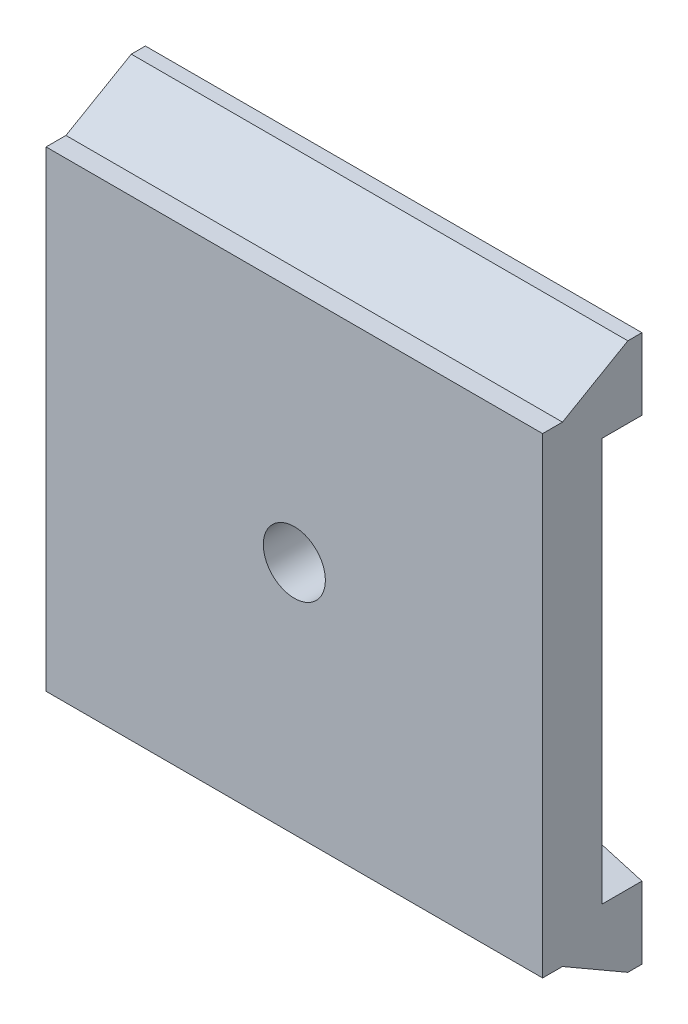
ISO-10303-21;
HEADER;
FILE_DESCRIPTION(('STEP AP214'),'2;1');
FILE_NAME('part.step','',(''),(''),'','','');
FILE_SCHEMA(('AUTOMOTIVE_DESIGN { 1 0 10303 214 1 1 1 1 }'));
ENDSEC;
DATA;
#1=APPLICATION_CONTEXT('core data for automotive mechanical design processes');
#2=APPLICATION_PROTOCOL_DEFINITION('international standard','automotive_design',2000,#1);
#3=PRODUCT_CONTEXT('',#1,'mechanical');
#4=PRODUCT('Part','Part','',(#3));
#5=PRODUCT_RELATED_PRODUCT_CATEGORY('part','',(#4));
#6=PRODUCT_DEFINITION_FORMATION('','',#4);
#7=PRODUCT_DEFINITION_CONTEXT('part definition',#1,'design');
#8=PRODUCT_DEFINITION('design','',#6,#7);
#9=PRODUCT_DEFINITION_SHAPE('','',#8);
#10=(LENGTH_UNIT() NAMED_UNIT(*) SI_UNIT(.MILLI.,.METRE.));
#11=(NAMED_UNIT(*) PLANE_ANGLE_UNIT() SI_UNIT($,.RADIAN.));
#12=(NAMED_UNIT(*) SI_UNIT($,.STERADIAN.) SOLID_ANGLE_UNIT());
#13=UNCERTAINTY_MEASURE_WITH_UNIT(LENGTH_MEASURE(1.E-05),#10,'distance_accuracy_value','');
#14=(GEOMETRIC_REPRESENTATION_CONTEXT(3) GLOBAL_UNCERTAINTY_ASSIGNED_CONTEXT((#13)) GLOBAL_UNIT_ASSIGNED_CONTEXT((#10,
#11,#12)) REPRESENTATION_CONTEXT('',''));
#15=CARTESIAN_POINT('',(0.,0.,0.));
#16=DIRECTION('',(0.,0.,1.));
#17=DIRECTION('',(1.,0.,0.));
#18=AXIS2_PLACEMENT_3D('',#15,#16,#17);
#19=CARTESIAN_POINT('',(25.4,-16.9926,4.064));
#20=DIRECTION('',(0.,-1.,0.));
#21=DIRECTION('',(0.,0.,-1.));
#22=AXIS2_PLACEMENT_3D('',#19,#20,#21);
#23=PLANE('',#22);
#24=DIRECTION('',(-1.,0.,0.));
#25=VECTOR('',#24,1.);
#26=CARTESIAN_POINT('',(25.4,-16.9926,0.));
#27=LINE('',#26,#25);
#28=CARTESIAN_POINT('',(-9.525,-16.9926,0.));
#29=VERTEX_POINT('',#28);
#30=CARTESIAN_POINT('',(-12.7,-16.9926,0.));
#31=VERTEX_POINT('',#30);
#32=EDGE_CURVE('E352',#29,#31,#27,.T.);
#33=ORIENTED_EDGE('',*,*,#32,.T.);
#34=DIRECTION('',(0.,0.,-1.));
#35=VECTOR('',#34,1.);
#36=CARTESIAN_POINT('',(-12.7,-16.9926,4.064));
#37=LINE('',#36,#35);
#38=CARTESIAN_POINT('',(-12.7,-16.9926,4.064));
#39=VERTEX_POINT('',#38);
#40=EDGE_CURVE('E246',#39,#31,#37,.T.);
#41=ORIENTED_EDGE('',*,*,#40,.F.);
#42=DIRECTION('',(-1.,0.,0.));
#43=VECTOR('',#42,1.);
#44=CARTESIAN_POINT('',(25.4,-16.9926,4.064));
#45=LINE('',#44,#43);
#46=CARTESIAN_POINT('',(-9.525,-16.9926,4.064));
#47=VERTEX_POINT('',#46);
#48=EDGE_CURVE('E346',#47,#39,#45,.T.);
#49=ORIENTED_EDGE('',*,*,#48,.F.);
#50=DIRECTION('',(0.,0.,-1.));
#51=VECTOR('',#50,1.);
#52=CARTESIAN_POINT('',(-9.525,-16.9926,4.064));
#53=LINE('',#52,#51);
#54=EDGE_CURVE('E338',#47,#29,#53,.T.);
#55=ORIENTED_EDGE('',*,*,#54,.T.);
#56=EDGE_LOOP('',(#33,#41,#49,#55));
#57=FACE_BOUND('',#56,.T.);
#58=ADVANCED_FACE('F33',(#57),#23,.F.);
#59=CARTESIAN_POINT('',(25.4,16.9926,4.064));
#60=DIRECTION('',(0.,1.,0.));
#61=DIRECTION('',(0.,0.,1.));
#62=AXIS2_PLACEMENT_3D('',#59,#60,#61);
#63=PLANE('',#62);
#64=DIRECTION('',(1.,0.,0.));
#65=VECTOR('',#64,1.);
#66=CARTESIAN_POINT('',(25.4,16.9926,4.064));
#67=LINE('',#66,#65);
#68=CARTESIAN_POINT('',(-12.7,16.9926,4.064));
#69=VERTEX_POINT('',#68);
#70=CARTESIAN_POINT('',(-9.525,16.9926,4.064));
#71=VERTEX_POINT('',#70);
#72=EDGE_CURVE('E342',#69,#71,#67,.T.);
#73=ORIENTED_EDGE('',*,*,#72,.F.);
#74=DIRECTION('',(0.,0.,-1.));
#75=VECTOR('',#74,1.);
#76=CARTESIAN_POINT('',(-12.7,16.9926,4.064));
#77=LINE('',#76,#75);
#78=CARTESIAN_POINT('',(-12.7,16.9926,0.));
#79=VERTEX_POINT('',#78);
#80=EDGE_CURVE('E232',#69,#79,#77,.T.);
#81=ORIENTED_EDGE('',*,*,#80,.T.);
#82=DIRECTION('',(1.,0.,0.));
#83=VECTOR('',#82,1.);
#84=CARTESIAN_POINT('',(25.4,16.9926,0.));
#85=LINE('',#84,#83);
#86=CARTESIAN_POINT('',(-9.525,16.9926,0.));
#87=VERTEX_POINT('',#86);
#88=EDGE_CURVE('E350',#79,#87,#85,.T.);
#89=ORIENTED_EDGE('',*,*,#88,.T.);
#90=DIRECTION('',(0.,0.,1.));
#91=VECTOR('',#90,1.);
#92=CARTESIAN_POINT('',(-9.525,16.9926,4.064));
#93=LINE('',#92,#91);
#94=EDGE_CURVE('E11',#87,#71,#93,.T.);
#95=ORIENTED_EDGE('',*,*,#94,.T.);
#96=EDGE_LOOP('',(#73,#81,#89,#95));
#97=FACE_BOUND('',#96,.T.);
#98=ADVANCED_FACE('F519',(#97),#63,.F.);
#99=CARTESIAN_POINT('',(0.,0.,0.));
#100=DIRECTION('',(0.,0.,1.));
#101=DIRECTION('',(1.,0.,0.));
#102=AXIS2_PLACEMENT_3D('',#99,#100,#101);
#103=PLANE('',#102);
#104=DIRECTION('',(0.,-1.,0.));
#105=VECTOR('',#104,1.);
#106=CARTESIAN_POINT('',(-25.4,27.9781,0.));
#107=LINE('',#106,#105);
#108=CARTESIAN_POINT('',(-25.4,-20.6587742093541,0.));
#109=VERTEX_POINT('',#108);
#110=CARTESIAN_POINT('',(-25.4,-27.9781,0.));
#111=VERTEX_POINT('',#110);
#112=EDGE_CURVE('E405',#109,#111,#107,.T.);
#113=ORIENTED_EDGE('',*,*,#112,.F.);
#114=DIRECTION('',(-0.960768922830524,-0.277350098112611,0.));
#115=VECTOR('',#114,1.);
#116=CARTESIAN_POINT('',(-12.7,-16.9926,0.));
#117=LINE('',#116,#115);
#118=EDGE_CURVE('E241',#31,#109,#117,.T.);
#119=ORIENTED_EDGE('',*,*,#118,.F.);
#120=ORIENTED_EDGE('',*,*,#32,.F.);
#121=DIRECTION('',(0.,1.,0.));
#122=VECTOR('',#121,1.);
#123=CARTESIAN_POINT('',(-9.525,17.8308,0.));
#124=LINE('',#123,#122);
#125=CARTESIAN_POINT('',(-9.525,-17.8308,0.));
#126=VERTEX_POINT('',#125);
#127=EDGE_CURVE('E274',#126,#29,#124,.T.);
#128=ORIENTED_EDGE('',*,*,#127,.F.);
#129=CARTESIAN_POINT('',(-6.35,-17.8308,0.));
#130=DIRECTION('',(0.,0.,-1.));
#131=DIRECTION('',(1.,0.,0.));
#132=AXIS2_PLACEMENT_3D('',#129,#130,#131);
#133=CIRCLE('',#132,3.175);
#134=CARTESIAN_POINT('',(-6.35,-21.0058,0.));
#135=VERTEX_POINT('',#134);
#136=EDGE_CURVE('E313',#135,#126,#133,.T.);
#137=ORIENTED_EDGE('',*,*,#136,.F.);
#138=DIRECTION('',(-1.,0.,0.));
#139=VECTOR('',#138,1.);
#140=CARTESIAN_POINT('',(-6.35,-21.0058,0.));
#141=LINE('',#140,#139);
#142=CARTESIAN_POINT('',(6.35,-21.0058,0.));
#143=VERTEX_POINT('',#142);
#144=EDGE_CURVE('E310',#143,#135,#141,.T.);
#145=ORIENTED_EDGE('',*,*,#144,.F.);
#146=CARTESIAN_POINT('',(6.35,-17.8308,0.));
#147=DIRECTION('',(0.,0.,-1.));
#148=DIRECTION('',(1.,0.,0.));
#149=AXIS2_PLACEMENT_3D('',#146,#147,#148);
#150=CIRCLE('',#149,3.175);
#151=CARTESIAN_POINT('',(9.525,-17.8308,0.));
#152=VERTEX_POINT('',#151);
#153=EDGE_CURVE('E307',#152,#143,#150,.T.);
#154=ORIENTED_EDGE('',*,*,#153,.F.);
#155=DIRECTION('',(0.,-1.,0.));
#156=VECTOR('',#155,1.);
#157=CARTESIAN_POINT('',(9.525,17.8308,0.));
#158=LINE('',#157,#156);
#159=CARTESIAN_POINT('',(9.525,-16.9926,0.));
#160=VERTEX_POINT('',#159);
#161=EDGE_CURVE('E304',#160,#152,#158,.T.);
#162=ORIENTED_EDGE('',*,*,#161,.F.);
#163=CARTESIAN_POINT('',(12.8616842040088,-16.9926,0.));
#164=VERTEX_POINT('',#163);
#165=EDGE_CURVE('E225',#164,#160,#27,.T.);
#166=ORIENTED_EDGE('',*,*,#165,.F.);
#167=DIRECTION('',(-0.960768922830524,0.277350098112611,0.));
#168=VECTOR('',#167,1.);
#169=CARTESIAN_POINT('',(12.8616842040088,-16.9926,0.));
#170=LINE('',#169,#168);
#171=CARTESIAN_POINT('',(25.4,-20.6121,0.));
#172=VERTEX_POINT('',#171);
#173=EDGE_CURVE('E250',#172,#164,#170,.T.);
#174=ORIENTED_EDGE('',*,*,#173,.F.);
#175=DIRECTION('',(0.,1.,0.));
#176=VECTOR('',#175,1.);
#177=CARTESIAN_POINT('',(25.4,27.9781,0.));
#178=LINE('',#177,#176);
#179=CARTESIAN_POINT('',(25.4,-27.9781,0.));
#180=VERTEX_POINT('',#179);
#181=EDGE_CURVE('E399',#180,#172,#178,.T.);
#182=ORIENTED_EDGE('',*,*,#181,.F.);
#183=DIRECTION('',(1.,0.,0.));
#184=VECTOR('',#183,1.);
#185=CARTESIAN_POINT('',(-25.4,-27.9781,0.));
#186=LINE('',#185,#184);
#187=EDGE_CURVE('E395',#111,#180,#186,.T.);
#188=ORIENTED_EDGE('',*,*,#187,.F.);
#189=EDGE_LOOP('',(#113,#119,#120,#128,#137,#145,#154,#162,#166,#174,#182,#188));
#190=FACE_BOUND('',#189,.T.);
#191=ADVANCED_FACE('F484',(#190),#103,.F.);
#192=CARTESIAN_POINT('',(-25.4,27.9781,10.16));
#193=DIRECTION('',(0.,-1.,0.));
#194=DIRECTION('',(0.,0.,-1.));
#195=AXIS2_PLACEMENT_3D('',#192,#193,#194);
#196=PLANE('',#195);
#197=DIRECTION('',(0.,0.,-1.));
#198=VECTOR('',#197,1.);
#199=CARTESIAN_POINT('',(-25.4,27.9781,10.16));
#200=LINE('',#199,#198);
#201=CARTESIAN_POINT('',(-25.4,27.9781,1.44089824213798));
#202=VERTEX_POINT('',#201);
#203=CARTESIAN_POINT('',(-25.4,27.9781,0.));
#204=VERTEX_POINT('',#203);
#205=EDGE_CURVE('E413',#202,#204,#200,.T.);
#206=ORIENTED_EDGE('',*,*,#205,.F.);
#207=DIRECTION('',(-1.,0.,0.));
#208=VECTOR('',#207,1.);
#209=CARTESIAN_POINT('',(25.4,27.9781,1.44089824213798));
#210=LINE('',#209,#208);
#211=CARTESIAN_POINT('',(25.4,27.9781,1.44089824213798));
#212=VERTEX_POINT('',#211);
#213=EDGE_CURVE('E369',#212,#202,#210,.T.);
#214=ORIENTED_EDGE('',*,*,#213,.F.);
#215=DIRECTION('',(0.,0.,-1.));
#216=VECTOR('',#215,1.);
#217=CARTESIAN_POINT('',(25.4,27.9781,10.16));
#218=LINE('',#217,#216);
#219=CARTESIAN_POINT('',(25.4,27.9781,0.));
#220=VERTEX_POINT('',#219);
#221=EDGE_CURVE('E415',#212,#220,#218,.T.);
#222=ORIENTED_EDGE('',*,*,#221,.T.);
#223=DIRECTION('',(-1.,0.,0.));
#224=VECTOR('',#223,1.);
#225=CARTESIAN_POINT('',(-25.4,27.9781,0.));
#226=LINE('',#225,#224);
#227=EDGE_CURVE('E402',#220,#204,#226,.T.);
#228=ORIENTED_EDGE('',*,*,#227,.T.);
#229=EDGE_LOOP('',(#206,#214,#222,#228));
#230=FACE_BOUND('',#229,.T.);
#231=ADVANCED_FACE('F516',(#230),#196,.F.);
#232=CARTESIAN_POINT('',(25.4,27.9781,10.16));
#233=DIRECTION('',(-1.,0.,0.));
#234=DIRECTION('',(0.,-1.,0.));
#235=AXIS2_PLACEMENT_3D('',#232,#233,#234);
#236=PLANE('',#235);
#237=ORIENTED_EDGE('',*,*,#181,.T.);
#238=DIRECTION('',(0.,0.,-1.));
#239=VECTOR('',#238,1.);
#240=CARTESIAN_POINT('',(25.4,-20.6121,4.064));
#241=LINE('',#240,#239);
#242=CARTESIAN_POINT('',(25.4,-20.6121,4.064));
#243=VERTEX_POINT('',#242);
#244=EDGE_CURVE('E253',#243,#172,#241,.T.);
#245=ORIENTED_EDGE('',*,*,#244,.F.);
#246=DIRECTION('',(0.,-1.,0.));
#247=VECTOR('',#246,1.);
#248=CARTESIAN_POINT('',(25.4,-16.9926,4.064));
#249=LINE('',#248,#247);
#250=CARTESIAN_POINT('',(25.4,20.6587742093541,4.064));
#251=VERTEX_POINT('',#250);
#252=EDGE_CURVE('E344',#251,#243,#249,.T.);
#253=ORIENTED_EDGE('',*,*,#252,.F.);
#254=DIRECTION('',(0.,0.,-1.));
#255=VECTOR('',#254,1.);
#256=CARTESIAN_POINT('',(25.4,20.6587742093541,4.064));
#257=LINE('',#256,#255);
#258=CARTESIAN_POINT('',(25.4,20.6587742093541,0.));
#259=VERTEX_POINT('',#258);
#260=EDGE_CURVE('E265',#251,#259,#257,.T.);
#261=ORIENTED_EDGE('',*,*,#260,.T.);
#262=EDGE_CURVE('E390',#259,#220,#178,.T.);
#263=ORIENTED_EDGE('',*,*,#262,.T.);
#264=ORIENTED_EDGE('',*,*,#221,.F.);
#265=DIRECTION('',(0.,-0.499999999999995,0.866025403784442));
#266=VECTOR('',#265,1.);
#267=CARTESIAN_POINT('',(25.4,24.1173,8.128));
#268=LINE('',#267,#266);
#269=CARTESIAN_POINT('',(25.4,24.1173,8.128));
#270=VERTEX_POINT('',#269);
#271=EDGE_CURVE('E366',#212,#270,#268,.T.);
#272=ORIENTED_EDGE('',*,*,#271,.T.);
#273=DIRECTION('',(0.,0.,1.));
#274=VECTOR('',#273,1.);
#275=CARTESIAN_POINT('',(25.4,24.1173,8.128));
#276=LINE('',#275,#274);
#277=CARTESIAN_POINT('',(25.4,24.1173,10.16));
#278=VERTEX_POINT('',#277);
#279=EDGE_CURVE('E387',#270,#278,#276,.T.);
#280=ORIENTED_EDGE('',*,*,#279,.T.);
#281=DIRECTION('',(0.,1.,0.));
#282=VECTOR('',#281,1.);
#283=CARTESIAN_POINT('',(25.4,27.9781,10.16));
#284=LINE('',#283,#282);
#285=CARTESIAN_POINT('',(25.4,-24.1173,10.16));
#286=VERTEX_POINT('',#285);
#287=EDGE_CURVE('E392',#286,#278,#284,.T.);
#288=ORIENTED_EDGE('',*,*,#287,.F.);
#289=DIRECTION('',(0.,0.,1.));
#290=VECTOR('',#289,1.);
#291=CARTESIAN_POINT('',(25.4,-24.1173,8.128));
#292=LINE('',#291,#290);
#293=CARTESIAN_POINT('',(25.4,-24.1173,8.128));
#294=VERTEX_POINT('',#293);
#295=EDGE_CURVE('E375',#294,#286,#292,.T.);
#296=ORIENTED_EDGE('',*,*,#295,.F.);
#297=DIRECTION('',(0.,-0.499999999999995,-0.866025403784442));
#298=VECTOR('',#297,1.);
#299=CARTESIAN_POINT('',(25.4,-24.1173,8.128));
#300=LINE('',#299,#298);
#301=CARTESIAN_POINT('',(25.4,-27.9781,1.44089824213799));
#302=VERTEX_POINT('',#301);
#303=EDGE_CURVE('E358',#294,#302,#300,.T.);
#304=ORIENTED_EDGE('',*,*,#303,.T.);
#305=DIRECTION('',(0.,0.,-1.));
#306=VECTOR('',#305,1.);
#307=CARTESIAN_POINT('',(25.4,-27.9781,10.16));
#308=LINE('',#307,#306);
#309=EDGE_CURVE('E398',#302,#180,#308,.T.);
#310=ORIENTED_EDGE('',*,*,#309,.T.);
#311=EDGE_LOOP('',(#237,#245,#253,#261,#263,#264,#272,#280,#288,#296,#304,#310));
#312=FACE_BOUND('',#311,.T.);
#313=ADVANCED_FACE('F35',(#312),#236,.F.);
#314=CARTESIAN_POINT('',(-25.4,27.9781,10.16));
#315=DIRECTION('',(1.,0.,0.));
#316=DIRECTION('',(0.,1.,0.));
#317=AXIS2_PLACEMENT_3D('',#314,#315,#316);
#318=PLANE('',#317);
#319=CARTESIAN_POINT('',(-25.4,20.6587742093541,0.));
#320=VERTEX_POINT('',#319);
#321=EDGE_CURVE('E239',#204,#320,#107,.T.);
#322=ORIENTED_EDGE('',*,*,#321,.T.);
#323=DIRECTION('',(0.,0.,-1.));
#324=VECTOR('',#323,1.);
#325=CARTESIAN_POINT('',(-25.4,20.6587742093541,4.064));
#326=LINE('',#325,#324);
#327=CARTESIAN_POINT('',(-25.4,20.6587742093541,4.064));
#328=VERTEX_POINT('',#327);
#329=EDGE_CURVE('E229',#328,#320,#326,.T.);
#330=ORIENTED_EDGE('',*,*,#329,.F.);
#331=DIRECTION('',(0.,1.,0.));
#332=VECTOR('',#331,1.);
#333=CARTESIAN_POINT('',(-25.4,-16.9926,4.064));
#334=LINE('',#333,#332);
#335=CARTESIAN_POINT('',(-25.4,-20.6587742093541,4.064));
#336=VERTEX_POINT('',#335);
#337=EDGE_CURVE('E215',#336,#328,#334,.T.);
#338=ORIENTED_EDGE('',*,*,#337,.F.);
#339=DIRECTION('',(0.,0.,-1.));
#340=VECTOR('',#339,1.);
#341=CARTESIAN_POINT('',(-25.4,-20.6587742093541,4.064));
#342=LINE('',#341,#340);
#343=EDGE_CURVE('E248',#336,#109,#342,.T.);
#344=ORIENTED_EDGE('',*,*,#343,.T.);
#345=ORIENTED_EDGE('',*,*,#112,.T.);
#346=DIRECTION('',(0.,0.,-1.));
#347=VECTOR('',#346,1.);
#348=CARTESIAN_POINT('',(-25.4,-27.9781,10.16));
#349=LINE('',#348,#347);
#350=CARTESIAN_POINT('',(-25.4,-27.9781,1.44089824213799));
#351=VERTEX_POINT('',#350);
#352=EDGE_CURVE('E410',#351,#111,#349,.T.);
#353=ORIENTED_EDGE('',*,*,#352,.F.);
#354=DIRECTION('',(0.,-0.499999999999995,-0.866025403784442));
#355=VECTOR('',#354,1.);
#356=CARTESIAN_POINT('',(-25.4,-24.1173,8.128));
#357=LINE('',#356,#355);
#358=CARTESIAN_POINT('',(-25.4,-24.1173,8.128));
#359=VERTEX_POINT('',#358);
#360=EDGE_CURVE('E357',#359,#351,#357,.T.);
#361=ORIENTED_EDGE('',*,*,#360,.F.);
#362=DIRECTION('',(0.,0.,1.));
#363=VECTOR('',#362,1.);
#364=CARTESIAN_POINT('',(-25.4,-24.1173,8.128));
#365=LINE('',#364,#363);
#366=CARTESIAN_POINT('',(-25.4,-24.1173,10.16));
#367=VERTEX_POINT('',#366);
#368=EDGE_CURVE('E377',#359,#367,#365,.T.);
#369=ORIENTED_EDGE('',*,*,#368,.T.);
#370=DIRECTION('',(0.,-1.,0.));
#371=VECTOR('',#370,1.);
#372=CARTESIAN_POINT('',(-25.4,27.9781,10.16));
#373=LINE('',#372,#371);
#374=CARTESIAN_POINT('',(-25.4,24.1173,10.16));
#375=VERTEX_POINT('',#374);
#376=EDGE_CURVE('E394',#375,#367,#373,.T.);
#377=ORIENTED_EDGE('',*,*,#376,.F.);
#378=DIRECTION('',(0.,0.,1.));
#379=VECTOR('',#378,1.);
#380=CARTESIAN_POINT('',(-25.4,24.1173,8.128));
#381=LINE('',#380,#379);
#382=CARTESIAN_POINT('',(-25.4,24.1173,8.128));
#383=VERTEX_POINT('',#382);
#384=EDGE_CURVE('E384',#383,#375,#381,.T.);
#385=ORIENTED_EDGE('',*,*,#384,.F.);
#386=DIRECTION('',(0.,-0.499999999999995,0.866025403784442));
#387=VECTOR('',#386,1.);
#388=CARTESIAN_POINT('',(-25.4,24.1173,8.128));
#389=LINE('',#388,#387);
#390=EDGE_CURVE('E365',#202,#383,#389,.T.);
#391=ORIENTED_EDGE('',*,*,#390,.F.);
#392=ORIENTED_EDGE('',*,*,#205,.T.);
#393=EDGE_LOOP('',(#322,#330,#338,#344,#345,#353,#361,#369,#377,#385,#391,#392));
#394=FACE_BOUND('',#393,.T.);
#395=ADVANCED_FACE('F237',(#394),#318,.F.);
#396=CARTESIAN_POINT('',(-25.4,-27.9781,10.16));
#397=DIRECTION('',(0.,1.,0.));
#398=DIRECTION('',(0.,0.,1.));
#399=AXIS2_PLACEMENT_3D('',#396,#397,#398);
#400=PLANE('',#399);
#401=ORIENTED_EDGE('',*,*,#309,.F.);
#402=DIRECTION('',(-1.,0.,0.));
#403=VECTOR('',#402,1.);
#404=CARTESIAN_POINT('',(25.4,-27.9781,1.44089824213799));
#405=LINE('',#404,#403);
#406=EDGE_CURVE('E361',#302,#351,#405,.T.);
#407=ORIENTED_EDGE('',*,*,#406,.T.);
#408=ORIENTED_EDGE('',*,*,#352,.T.);
#409=ORIENTED_EDGE('',*,*,#187,.T.);
#410=EDGE_LOOP('',(#401,#407,#408,#409));
#411=FACE_BOUND('',#410,.T.);
#412=ADVANCED_FACE('F491',(#411),#400,.F.);
#413=CARTESIAN_POINT('',(0.,0.,10.16));
#414=DIRECTION('',(0.,0.,1.));
#415=DIRECTION('',(1.,0.,0.));
#416=AXIS2_PLACEMENT_3D('',#413,#414,#415);
#417=PLANE('',#416);
#418=CARTESIAN_POINT('',(0.,0.,10.16));
#419=DIRECTION('',(0.,0.,1.));
#420=DIRECTION('',(1.,0.,0.));
#421=AXIS2_PLACEMENT_3D('',#418,#419,#420);
#422=CIRCLE('',#421,3.175);
#423=CARTESIAN_POINT('',(3.175,0.,10.16));
#424=VERTEX_POINT('',#423);
#425=EDGE_CURVE('E354',#424,#424,#422,.T.);
#426=ORIENTED_EDGE('',*,*,#425,.F.);
#427=EDGE_LOOP('',(#426));
#428=FACE_BOUND('',#427,.T.);
#429=DIRECTION('',(-1.,0.,0.));
#430=VECTOR('',#429,1.);
#431=CARTESIAN_POINT('',(-25.4,-24.1173,10.16));
#432=LINE('',#431,#430);
#433=EDGE_CURVE('E372',#286,#367,#432,.T.);
#434=ORIENTED_EDGE('',*,*,#433,.F.);
#435=ORIENTED_EDGE('',*,*,#287,.T.);
#436=DIRECTION('',(1.,0.,0.));
#437=VECTOR('',#436,1.);
#438=CARTESIAN_POINT('',(-25.4,24.1173,10.16));
#439=LINE('',#438,#437);
#440=EDGE_CURVE('E380',#375,#278,#439,.T.);
#441=ORIENTED_EDGE('',*,*,#440,.F.);
#442=ORIENTED_EDGE('',*,*,#376,.T.);
#443=EDGE_LOOP('',(#434,#435,#441,#442));
#444=FACE_BOUND('',#443,.T.);
#445=ADVANCED_FACE('F502',(#428,#444),#417,.T.);
#446=ORIENTED_EDGE('',*,*,#88,.F.);
#447=DIRECTION('',(0.960768922830524,-0.277350098112611,0.));
#448=VECTOR('',#447,1.);
#449=CARTESIAN_POINT('',(-12.7,16.9926,0.));
#450=LINE('',#449,#448);
#451=EDGE_CURVE('E234',#320,#79,#450,.T.);
#452=ORIENTED_EDGE('',*,*,#451,.F.);
#453=ORIENTED_EDGE('',*,*,#321,.F.);
#454=ORIENTED_EDGE('',*,*,#227,.F.);
#455=ORIENTED_EDGE('',*,*,#262,.F.);
#456=DIRECTION('',(0.960768922830524,0.27735009811261,0.));
#457=VECTOR('',#456,1.);
#458=CARTESIAN_POINT('',(12.7,16.9926,0.));
#459=LINE('',#458,#457);
#460=CARTESIAN_POINT('',(12.7,16.9926,0.));
#461=VERTEX_POINT('',#460);
#462=EDGE_CURVE('E258',#461,#259,#459,.T.);
#463=ORIENTED_EDGE('',*,*,#462,.F.);
#464=CARTESIAN_POINT('',(9.525,16.9926,0.));
#465=VERTEX_POINT('',#464);
#466=EDGE_CURVE('E340',#465,#461,#85,.T.);
#467=ORIENTED_EDGE('',*,*,#466,.F.);
#468=CARTESIAN_POINT('',(9.525,17.8308,0.));
#469=VERTEX_POINT('',#468);
#470=EDGE_CURVE('E305',#469,#465,#158,.T.);
#471=ORIENTED_EDGE('',*,*,#470,.F.);
#472=CARTESIAN_POINT('',(6.35,17.8308,0.));
#473=DIRECTION('',(0.,0.,-1.));
#474=DIRECTION('',(-1.,0.,0.));
#475=AXIS2_PLACEMENT_3D('',#472,#473,#474);
#476=CIRCLE('',#475,3.175);
#477=CARTESIAN_POINT('',(6.35,21.0058,0.));
#478=VERTEX_POINT('',#477);
#479=EDGE_CURVE('E301',#478,#469,#476,.T.);
#480=ORIENTED_EDGE('',*,*,#479,.F.);
#481=DIRECTION('',(1.,0.,0.));
#482=VECTOR('',#481,1.);
#483=CARTESIAN_POINT('',(-6.35,21.0058,0.));
#484=LINE('',#483,#482);
#485=CARTESIAN_POINT('',(-6.35,21.0058,0.));
#486=VERTEX_POINT('',#485);
#487=EDGE_CURVE('E298',#486,#478,#484,.T.);
#488=ORIENTED_EDGE('',*,*,#487,.F.);
#489=CARTESIAN_POINT('',(-6.35,17.8308,0.));
#490=DIRECTION('',(0.,0.,-1.));
#491=DIRECTION('',(1.,0.,0.));
#492=AXIS2_PLACEMENT_3D('',#489,#490,#491);
#493=CIRCLE('',#492,3.175);
#494=CARTESIAN_POINT('',(-9.525,17.8308,0.));
#495=VERTEX_POINT('',#494);
#496=EDGE_CURVE('E268',#495,#486,#493,.T.);
#497=ORIENTED_EDGE('',*,*,#496,.F.);
#498=EDGE_CURVE('E316',#87,#495,#124,.T.);
#499=ORIENTED_EDGE('',*,*,#498,.F.);
#500=EDGE_LOOP('',(#446,#452,#453,#454,#455,#463,#467,#471,#480,#488,#497,#499));
#501=FACE_BOUND('',#500,.T.);
#502=ADVANCED_FACE('F434',(#501),#103,.F.);
#503=CARTESIAN_POINT('',(-25.4,24.1173,8.128));
#504=DIRECTION('',(0.,-1.,0.));
#505=DIRECTION('',(1.,0.,0.));
#506=AXIS2_PLACEMENT_3D('',#503,#504,#505);
#507=PLANE('',#506);
#508=ORIENTED_EDGE('',*,*,#440,.T.);
#509=ORIENTED_EDGE('',*,*,#279,.F.);
#510=DIRECTION('',(1.,0.,0.));
#511=VECTOR('',#510,1.);
#512=CARTESIAN_POINT('',(-25.4,24.1173,8.128));
#513=LINE('',#512,#511);
#514=EDGE_CURVE('E382',#383,#270,#513,.T.);
#515=ORIENTED_EDGE('',*,*,#514,.F.);
#516=ORIENTED_EDGE('',*,*,#384,.T.);
#517=EDGE_LOOP('',(#508,#509,#515,#516));
#518=FACE_BOUND('',#517,.T.);
#519=ADVANCED_FACE('F510',(#518),#507,.F.);
#520=CARTESIAN_POINT('',(-25.4,-24.1173,8.128));
#521=DIRECTION('',(0.,1.,0.));
#522=DIRECTION('',(0.,0.,1.));
#523=AXIS2_PLACEMENT_3D('',#520,#521,#522);
#524=PLANE('',#523);
#525=ORIENTED_EDGE('',*,*,#433,.T.);
#526=ORIENTED_EDGE('',*,*,#368,.F.);
#527=DIRECTION('',(-1.,0.,0.));
#528=VECTOR('',#527,1.);
#529=CARTESIAN_POINT('',(-25.4,-24.1173,8.128));
#530=LINE('',#529,#528);
#531=EDGE_CURVE('E373',#294,#359,#530,.T.);
#532=ORIENTED_EDGE('',*,*,#531,.F.);
#533=ORIENTED_EDGE('',*,*,#295,.T.);
#534=EDGE_LOOP('',(#525,#526,#532,#533));
#535=FACE_BOUND('',#534,.T.);
#536=ADVANCED_FACE('F499',(#535),#524,.F.);
#537=CARTESIAN_POINT('',(25.4,24.1173,8.128));
#538=DIRECTION('',(0.,-0.866025403784442,-0.499999999999995));
#539=DIRECTION('',(0.,0.499999999999995,-0.866025403784442));
#540=AXIS2_PLACEMENT_3D('',#537,#538,#539);
#541=PLANE('',#540);
#542=ORIENTED_EDGE('',*,*,#390,.T.);
#543=ORIENTED_EDGE('',*,*,#514,.T.);
#544=ORIENTED_EDGE('',*,*,#271,.F.);
#545=ORIENTED_EDGE('',*,*,#213,.T.);
#546=EDGE_LOOP('',(#542,#543,#544,#545));
#547=FACE_BOUND('',#546,.T.);
#548=ADVANCED_FACE('F513',(#547),#541,.F.);
#549=CARTESIAN_POINT('',(25.4,-24.1173,8.128));
#550=DIRECTION('',(0.,0.866025403784442,-0.499999999999995));
#551=DIRECTION('',(0.,0.499999999999995,0.866025403784442));
#552=AXIS2_PLACEMENT_3D('',#549,#550,#551);
#553=PLANE('',#552);
#554=ORIENTED_EDGE('',*,*,#360,.T.);
#555=ORIENTED_EDGE('',*,*,#406,.F.);
#556=ORIENTED_EDGE('',*,*,#303,.F.);
#557=ORIENTED_EDGE('',*,*,#531,.T.);
#558=EDGE_LOOP('',(#554,#555,#556,#557));
#559=FACE_BOUND('',#558,.T.);
#560=ADVANCED_FACE('F493',(#559),#553,.F.);
#561=CARTESIAN_POINT('',(0.,0.,0.));
#562=DIRECTION('',(0.,0.,1.));
#563=DIRECTION('',(1.,0.,0.));
#564=AXIS2_PLACEMENT_3D('',#561,#562,#563);
#565=CYLINDRICAL_SURFACE('',#564,3.175);
#566=CARTESIAN_POINT('',(0.,0.,4.064));
#567=DIRECTION('',(0.,0.,1.));
#568=DIRECTION('',(1.,0.,0.));
#569=AXIS2_PLACEMENT_3D('',#566,#567,#568);
#570=CIRCLE('',#569,3.175);
#571=CARTESIAN_POINT('',(3.175,0.,4.064));
#572=VERTEX_POINT('',#571);
#573=EDGE_CURVE('E349',#572,#572,#570,.F.);
#574=ORIENTED_EDGE('',*,*,#573,.T.);
#575=EDGE_LOOP('',(#574));
#576=FACE_BOUND('',#575,.T.);
#577=ORIENTED_EDGE('',*,*,#425,.T.);
#578=EDGE_LOOP('',(#577));
#579=FACE_BOUND('',#578,.T.);
#580=ADVANCED_FACE('F558',(#576,#579),#565,.F.);
#581=CARTESIAN_POINT('',(0.,0.,4.064));
#582=DIRECTION('',(0.,0.,1.));
#583=DIRECTION('',(1.,0.,0.));
#584=AXIS2_PLACEMENT_3D('',#581,#582,#583);
#585=PLANE('',#584);
#586=ORIENTED_EDGE('',*,*,#252,.T.);
#587=DIRECTION('',(-0.960768922830524,0.277350098112611,0.));
#588=VECTOR('',#587,1.);
#589=CARTESIAN_POINT('',(12.8616842040088,-16.9926,4.064));
#590=LINE('',#589,#588);
#591=CARTESIAN_POINT('',(12.8616842040088,-16.9926,4.064));
#592=VERTEX_POINT('',#591);
#593=EDGE_CURVE('E55',#243,#592,#590,.T.);
#594=ORIENTED_EDGE('',*,*,#593,.T.);
#595=CARTESIAN_POINT('',(9.525,-16.9926,4.064));
#596=VERTEX_POINT('',#595);
#597=EDGE_CURVE('E347',#592,#596,#45,.T.);
#598=ORIENTED_EDGE('',*,*,#597,.T.);
#599=DIRECTION('',(0.,-1.,0.));
#600=VECTOR('',#599,1.);
#601=CARTESIAN_POINT('',(9.525,17.8308,4.064));
#602=LINE('',#601,#600);
#603=CARTESIAN_POINT('',(9.525,-17.8308,4.064));
#604=VERTEX_POINT('',#603);
#605=EDGE_CURVE('E280',#596,#604,#602,.T.);
#606=ORIENTED_EDGE('',*,*,#605,.T.);
#607=CARTESIAN_POINT('',(6.35,-17.8308,4.064));
#608=DIRECTION('',(0.,0.,-1.));
#609=DIRECTION('',(1.,0.,0.));
#610=AXIS2_PLACEMENT_3D('',#607,#608,#609);
#611=CIRCLE('',#610,3.175);
#612=CARTESIAN_POINT('',(6.35,-21.0058,4.064));
#613=VERTEX_POINT('',#612);
#614=EDGE_CURVE('E283',#604,#613,#611,.T.);
#615=ORIENTED_EDGE('',*,*,#614,.T.);
#616=DIRECTION('',(-1.,0.,0.));
#617=VECTOR('',#616,1.);
#618=CARTESIAN_POINT('',(-6.35,-21.0058,4.064));
#619=LINE('',#618,#617);
#620=CARTESIAN_POINT('',(-6.35,-21.0058,4.064));
#621=VERTEX_POINT('',#620);
#622=EDGE_CURVE('E286',#613,#621,#619,.T.);
#623=ORIENTED_EDGE('',*,*,#622,.T.);
#624=CARTESIAN_POINT('',(-6.35,-17.8308,4.064));
#625=DIRECTION('',(0.,0.,-1.));
#626=DIRECTION('',(1.,0.,0.));
#627=AXIS2_PLACEMENT_3D('',#624,#625,#626);
#628=CIRCLE('',#627,3.175);
#629=CARTESIAN_POINT('',(-9.525,-17.8308,4.064));
#630=VERTEX_POINT('',#629);
#631=EDGE_CURVE('E289',#621,#630,#628,.T.);
#632=ORIENTED_EDGE('',*,*,#631,.T.);
#633=DIRECTION('',(0.,1.,0.));
#634=VECTOR('',#633,1.);
#635=CARTESIAN_POINT('',(-9.525,17.8308,4.064));
#636=LINE('',#635,#634);
#637=EDGE_CURVE('E293',#630,#47,#636,.T.);
#638=ORIENTED_EDGE('',*,*,#637,.T.);
#639=ORIENTED_EDGE('',*,*,#48,.T.);
#640=DIRECTION('',(-0.960768922830524,-0.277350098112611,0.));
#641=VECTOR('',#640,1.);
#642=CARTESIAN_POINT('',(-12.7,-16.9926,4.064));
#643=LINE('',#642,#641);
#644=EDGE_CURVE('E219',#39,#336,#643,.T.);
#645=ORIENTED_EDGE('',*,*,#644,.T.);
#646=ORIENTED_EDGE('',*,*,#337,.T.);
#647=DIRECTION('',(0.960768922830524,-0.277350098112611,0.));
#648=VECTOR('',#647,1.);
#649=CARTESIAN_POINT('',(-12.7,16.9926,4.064));
#650=LINE('',#649,#648);
#651=EDGE_CURVE('E48',#328,#69,#650,.T.);
#652=ORIENTED_EDGE('',*,*,#651,.T.);
#653=ORIENTED_EDGE('',*,*,#72,.T.);
#654=CARTESIAN_POINT('',(-9.525,17.8308,4.064));
#655=VERTEX_POINT('',#654);
#656=EDGE_CURVE('E292',#71,#655,#636,.T.);
#657=ORIENTED_EDGE('',*,*,#656,.T.);
#658=CARTESIAN_POINT('',(-6.35,17.8308,4.064));
#659=DIRECTION('',(0.,0.,-1.));
#660=DIRECTION('',(1.,0.,0.));
#661=AXIS2_PLACEMENT_3D('',#658,#659,#660);
#662=CIRCLE('',#661,3.175);
#663=CARTESIAN_POINT('',(-6.35,21.0058,4.064));
#664=VERTEX_POINT('',#663);
#665=EDGE_CURVE('E270',#655,#664,#662,.T.);
#666=ORIENTED_EDGE('',*,*,#665,.T.);
#667=DIRECTION('',(1.,0.,0.));
#668=VECTOR('',#667,1.);
#669=CARTESIAN_POINT('',(-6.35,21.0058,4.064));
#670=LINE('',#669,#668);
#671=CARTESIAN_POINT('',(6.35,21.0058,4.064));
#672=VERTEX_POINT('',#671);
#673=EDGE_CURVE('E273',#664,#672,#670,.T.);
#674=ORIENTED_EDGE('',*,*,#673,.T.);
#675=CARTESIAN_POINT('',(6.35,17.8308,4.064));
#676=DIRECTION('',(0.,0.,-1.));
#677=DIRECTION('',(-1.,0.,0.));
#678=AXIS2_PLACEMENT_3D('',#675,#676,#677);
#679=CIRCLE('',#678,3.175);
#680=CARTESIAN_POINT('',(9.525,17.8308,4.064));
#681=VERTEX_POINT('',#680);
#682=EDGE_CURVE('E277',#672,#681,#679,.T.);
#683=ORIENTED_EDGE('',*,*,#682,.T.);
#684=CARTESIAN_POINT('',(9.525,16.9926,4.064));
#685=VERTEX_POINT('',#684);
#686=EDGE_CURVE('E281',#681,#685,#602,.T.);
#687=ORIENTED_EDGE('',*,*,#686,.T.);
#688=CARTESIAN_POINT('',(12.7,16.9926,4.064));
#689=VERTEX_POINT('',#688);
#690=EDGE_CURVE('E224',#685,#689,#67,.T.);
#691=ORIENTED_EDGE('',*,*,#690,.T.);
#692=DIRECTION('',(0.960768922830524,0.27735009811261,0.));
#693=VECTOR('',#692,1.);
#694=CARTESIAN_POINT('',(12.7,16.9926,4.064));
#695=LINE('',#694,#693);
#696=EDGE_CURVE('E260',#689,#251,#695,.T.);
#697=ORIENTED_EDGE('',*,*,#696,.T.);
#698=EDGE_LOOP('',(#586,#594,#598,#606,#615,#623,#632,#638,#639,#645,#646,#652,#653,#657,#666,
#674,#683,#687,#691,#697));
#699=FACE_BOUND('',#698,.T.);
#700=ORIENTED_EDGE('',*,*,#573,.F.);
#701=EDGE_LOOP('',(#700));
#702=FACE_BOUND('',#701,.T.);
#703=ADVANCED_FACE('F216',(#699,#702),#585,.F.);
#704=ORIENTED_EDGE('',*,*,#597,.F.);
#705=DIRECTION('',(0.,0.,-1.));
#706=VECTOR('',#705,1.);
#707=CARTESIAN_POINT('',(12.8616842040088,-16.9926,4.064));
#708=LINE('',#707,#706);
#709=EDGE_CURVE('E255',#592,#164,#708,.T.);
#710=ORIENTED_EDGE('',*,*,#709,.T.);
#711=ORIENTED_EDGE('',*,*,#165,.T.);
#712=DIRECTION('',(0.,0.,1.));
#713=VECTOR('',#712,1.);
#714=CARTESIAN_POINT('',(9.525,-16.9926,4.064));
#715=LINE('',#714,#713);
#716=EDGE_CURVE('E321',#160,#596,#715,.T.);
#717=ORIENTED_EDGE('',*,*,#716,.T.);
#718=EDGE_LOOP('',(#704,#710,#711,#717));
#719=FACE_BOUND('',#718,.T.);
#720=ADVANCED_FACE('F450',(#719),#23,.F.);
#721=ORIENTED_EDGE('',*,*,#466,.T.);
#722=DIRECTION('',(0.,0.,-1.));
#723=VECTOR('',#722,1.);
#724=CARTESIAN_POINT('',(12.7,16.9926,4.064));
#725=LINE('',#724,#723);
#726=EDGE_CURVE('E263',#689,#461,#725,.T.);
#727=ORIENTED_EDGE('',*,*,#726,.F.);
#728=ORIENTED_EDGE('',*,*,#690,.F.);
#729=DIRECTION('',(0.,0.,-1.));
#730=VECTOR('',#729,1.);
#731=CARTESIAN_POINT('',(9.525,16.9926,4.064));
#732=LINE('',#731,#730);
#733=EDGE_CURVE('E41',#685,#465,#732,.T.);
#734=ORIENTED_EDGE('',*,*,#733,.T.);
#735=EDGE_LOOP('',(#721,#727,#728,#734));
#736=FACE_BOUND('',#735,.T.);
#737=ADVANCED_FACE('F425',(#736),#63,.F.);
#738=CARTESIAN_POINT('',(9.525,17.8308,4.064));
#739=DIRECTION('',(1.,0.,0.));
#740=DIRECTION('',(0.,0.,-1.));
#741=AXIS2_PLACEMENT_3D('',#738,#739,#740);
#742=PLANE('',#741);
#743=ORIENTED_EDGE('',*,*,#686,.F.);
#744=DIRECTION('',(0.,0.,-1.));
#745=VECTOR('',#744,1.);
#746=CARTESIAN_POINT('',(9.525,17.8308,4.064));
#747=LINE('',#746,#745);
#748=EDGE_CURVE('E331',#681,#469,#747,.T.);
#749=ORIENTED_EDGE('',*,*,#748,.T.);
#750=ORIENTED_EDGE('',*,*,#470,.T.);
#751=ORIENTED_EDGE('',*,*,#733,.F.);
#752=EDGE_LOOP('',(#743,#749,#750,#751));
#753=FACE_BOUND('',#752,.T.);
#754=ADVANCED_FACE('F536',(#753),#742,.F.);
#755=CARTESIAN_POINT('',(-9.525,17.8308,4.064));
#756=DIRECTION('',(-1.,0.,0.));
#757=DIRECTION('',(0.,-1.,0.));
#758=AXIS2_PLACEMENT_3D('',#755,#756,#757);
#759=PLANE('',#758);
#760=ORIENTED_EDGE('',*,*,#498,.T.);
#761=DIRECTION('',(0.,0.,-1.));
#762=VECTOR('',#761,1.);
#763=CARTESIAN_POINT('',(-9.525,17.8308,4.064));
#764=LINE('',#763,#762);
#765=EDGE_CURVE('E318',#655,#495,#764,.T.);
#766=ORIENTED_EDGE('',*,*,#765,.F.);
#767=ORIENTED_EDGE('',*,*,#656,.F.);
#768=ORIENTED_EDGE('',*,*,#94,.F.);
#769=EDGE_LOOP('',(#760,#766,#767,#768));
#770=FACE_BOUND('',#769,.T.);
#771=ADVANCED_FACE('F524',(#770),#759,.F.);
#772=CARTESIAN_POINT('',(-6.35,21.0058,4.064));
#773=DIRECTION('',(0.,1.,0.));
#774=DIRECTION('',(-1.,0.,0.));
#775=AXIS2_PLACEMENT_3D('',#772,#773,#774);
#776=PLANE('',#775);
#777=ORIENTED_EDGE('',*,*,#487,.T.);
#778=DIRECTION('',(0.,0.,-1.));
#779=VECTOR('',#778,1.);
#780=CARTESIAN_POINT('',(6.35,21.0058,4.064));
#781=LINE('',#780,#779);
#782=EDGE_CURVE('E333',#672,#478,#781,.T.);
#783=ORIENTED_EDGE('',*,*,#782,.F.);
#784=ORIENTED_EDGE('',*,*,#673,.F.);
#785=DIRECTION('',(0.,0.,-1.));
#786=VECTOR('',#785,1.);
#787=CARTESIAN_POINT('',(-6.35,21.0058,4.064));
#788=LINE('',#787,#786);
#789=EDGE_CURVE('E295',#664,#486,#788,.T.);
#790=ORIENTED_EDGE('',*,*,#789,.T.);
#791=EDGE_LOOP('',(#777,#783,#784,#790));
#792=FACE_BOUND('',#791,.T.);
#793=ADVANCED_FACE('F532',(#792),#776,.F.);
#794=CARTESIAN_POINT('',(6.35,17.8308,4.064));
#795=DIRECTION('',(0.,0.,-1.));
#796=DIRECTION('',(-1.,0.,0.));
#797=AXIS2_PLACEMENT_3D('',#794,#795,#796);
#798=CYLINDRICAL_SURFACE('',#797,3.175);
#799=ORIENTED_EDGE('',*,*,#479,.T.);
#800=ORIENTED_EDGE('',*,*,#748,.F.);
#801=ORIENTED_EDGE('',*,*,#682,.F.);
#802=ORIENTED_EDGE('',*,*,#782,.T.);
#803=EDGE_LOOP('',(#799,#800,#801,#802));
#804=FACE_BOUND('',#803,.T.);
#805=ADVANCED_FACE('F535',(#804),#798,.F.);
#806=CARTESIAN_POINT('',(-6.35,17.8308,4.064));
#807=DIRECTION('',(0.,0.,-1.));
#808=DIRECTION('',(-1.,0.,0.));
#809=AXIS2_PLACEMENT_3D('',#806,#807,#808);
#810=CYLINDRICAL_SURFACE('',#809,3.175);
#811=ORIENTED_EDGE('',*,*,#496,.T.);
#812=ORIENTED_EDGE('',*,*,#789,.F.);
#813=ORIENTED_EDGE('',*,*,#665,.F.);
#814=ORIENTED_EDGE('',*,*,#765,.T.);
#815=EDGE_LOOP('',(#811,#812,#813,#814));
#816=FACE_BOUND('',#815,.T.);
#817=ADVANCED_FACE('F528',(#816),#810,.F.);
#818=ORIENTED_EDGE('',*,*,#637,.F.);
#819=DIRECTION('',(0.,0.,-1.));
#820=VECTOR('',#819,1.);
#821=CARTESIAN_POINT('',(-9.525,-17.8308,4.064));
#822=LINE('',#821,#820);
#823=EDGE_CURVE('E322',#630,#126,#822,.T.);
#824=ORIENTED_EDGE('',*,*,#823,.T.);
#825=ORIENTED_EDGE('',*,*,#127,.T.);
#826=ORIENTED_EDGE('',*,*,#54,.F.);
#827=EDGE_LOOP('',(#818,#824,#825,#826));
#828=FACE_BOUND('',#827,.T.);
#829=ADVANCED_FACE('F472',(#828),#759,.F.);
#830=ORIENTED_EDGE('',*,*,#161,.T.);
#831=DIRECTION('',(0.,0.,-1.));
#832=VECTOR('',#831,1.);
#833=CARTESIAN_POINT('',(9.525,-17.8308,4.064));
#834=LINE('',#833,#832);
#835=EDGE_CURVE('E328',#604,#152,#834,.T.);
#836=ORIENTED_EDGE('',*,*,#835,.F.);
#837=ORIENTED_EDGE('',*,*,#605,.F.);
#838=ORIENTED_EDGE('',*,*,#716,.F.);
#839=EDGE_LOOP('',(#830,#836,#837,#838));
#840=FACE_BOUND('',#839,.T.);
#841=ADVANCED_FACE('F455',(#840),#742,.F.);
#842=CARTESIAN_POINT('',(-6.35,-17.8308,4.064));
#843=DIRECTION('',(0.,0.,-1.));
#844=DIRECTION('',(-1.,0.,0.));
#845=AXIS2_PLACEMENT_3D('',#842,#843,#844);
#846=CYLINDRICAL_SURFACE('',#845,3.175);
#847=ORIENTED_EDGE('',*,*,#136,.T.);
#848=ORIENTED_EDGE('',*,*,#823,.F.);
#849=ORIENTED_EDGE('',*,*,#631,.F.);
#850=DIRECTION('',(0.,0.,-1.));
#851=VECTOR('',#850,1.);
#852=CARTESIAN_POINT('',(-6.35,-21.0058,4.064));
#853=LINE('',#852,#851);
#854=EDGE_CURVE('E324',#621,#135,#853,.T.);
#855=ORIENTED_EDGE('',*,*,#854,.T.);
#856=EDGE_LOOP('',(#847,#848,#849,#855));
#857=FACE_BOUND('',#856,.T.);
#858=ADVANCED_FACE('F469',(#857),#846,.F.);
#859=CARTESIAN_POINT('',(-6.35,-21.0058,4.064));
#860=DIRECTION('',(0.,-1.,0.));
#861=DIRECTION('',(1.,0.,0.));
#862=AXIS2_PLACEMENT_3D('',#859,#860,#861);
#863=PLANE('',#862);
#864=ORIENTED_EDGE('',*,*,#144,.T.);
#865=ORIENTED_EDGE('',*,*,#854,.F.);
#866=ORIENTED_EDGE('',*,*,#622,.F.);
#867=DIRECTION('',(0.,0.,-1.));
#868=VECTOR('',#867,1.);
#869=CARTESIAN_POINT('',(6.35,-21.0058,4.064));
#870=LINE('',#869,#868);
#871=EDGE_CURVE('E326',#613,#143,#870,.T.);
#872=ORIENTED_EDGE('',*,*,#871,.T.);
#873=EDGE_LOOP('',(#864,#865,#866,#872));
#874=FACE_BOUND('',#873,.T.);
#875=ADVANCED_FACE('F465',(#874),#863,.F.);
#876=CARTESIAN_POINT('',(6.35,-17.8308,4.064));
#877=DIRECTION('',(0.,0.,-1.));
#878=DIRECTION('',(-1.,0.,0.));
#879=AXIS2_PLACEMENT_3D('',#876,#877,#878);
#880=CYLINDRICAL_SURFACE('',#879,3.175);
#881=ORIENTED_EDGE('',*,*,#153,.T.);
#882=ORIENTED_EDGE('',*,*,#871,.F.);
#883=ORIENTED_EDGE('',*,*,#614,.F.);
#884=ORIENTED_EDGE('',*,*,#835,.T.);
#885=EDGE_LOOP('',(#881,#882,#883,#884));
#886=FACE_BOUND('',#885,.T.);
#887=ADVANCED_FACE('F460',(#886),#880,.F.);
#888=CARTESIAN_POINT('',(12.7,16.9926,4.064));
#889=DIRECTION('',(-0.277350098112611,0.960768922830524,0.));
#890=DIRECTION('',(-0.960768922830524,-0.277350098112611,0.));
#891=AXIS2_PLACEMENT_3D('',#888,#889,#890);
#892=PLANE('',#891);
#893=ORIENTED_EDGE('',*,*,#462,.T.);
#894=ORIENTED_EDGE('',*,*,#260,.F.);
#895=ORIENTED_EDGE('',*,*,#696,.F.);
#896=ORIENTED_EDGE('',*,*,#726,.T.);
#897=EDGE_LOOP('',(#893,#894,#895,#896));
#898=FACE_BOUND('',#897,.T.);
#899=ADVANCED_FACE('F440',(#898),#892,.F.);
#900=CARTESIAN_POINT('',(12.8616842040088,-16.9926,4.064));
#901=DIRECTION('',(-0.277350098112611,-0.960768922830524,0.));
#902=DIRECTION('',(0.960768922830524,-0.277350098112611,0.));
#903=AXIS2_PLACEMENT_3D('',#900,#901,#902);
#904=PLANE('',#903);
#905=ORIENTED_EDGE('',*,*,#173,.T.);
#906=ORIENTED_EDGE('',*,*,#709,.F.);
#907=ORIENTED_EDGE('',*,*,#593,.F.);
#908=ORIENTED_EDGE('',*,*,#244,.T.);
#909=EDGE_LOOP('',(#905,#906,#907,#908));
#910=FACE_BOUND('',#909,.T.);
#911=ADVANCED_FACE('F445',(#910),#904,.F.);
#912=CARTESIAN_POINT('',(-12.7,-16.9926,4.064));
#913=DIRECTION('',(0.277350098112611,-0.960768922830524,0.));
#914=DIRECTION('',(0.960768922830524,0.277350098112611,0.));
#915=AXIS2_PLACEMENT_3D('',#912,#913,#914);
#916=PLANE('',#915);
#917=ORIENTED_EDGE('',*,*,#118,.T.);
#918=ORIENTED_EDGE('',*,*,#343,.F.);
#919=ORIENTED_EDGE('',*,*,#644,.F.);
#920=ORIENTED_EDGE('',*,*,#40,.T.);
#921=EDGE_LOOP('',(#917,#918,#919,#920));
#922=FACE_BOUND('',#921,.T.);
#923=ADVANCED_FACE('F481',(#922),#916,.F.);
#924=CARTESIAN_POINT('',(-12.7,16.9926,4.064));
#925=DIRECTION('',(0.277350098112611,0.960768922830524,0.));
#926=DIRECTION('',(-0.960768922830524,0.277350098112611,0.));
#927=AXIS2_PLACEMENT_3D('',#924,#925,#926);
#928=PLANE('',#927);
#929=ORIENTED_EDGE('',*,*,#451,.T.);
#930=ORIENTED_EDGE('',*,*,#80,.F.);
#931=ORIENTED_EDGE('',*,*,#651,.F.);
#932=ORIENTED_EDGE('',*,*,#329,.T.);
#933=EDGE_LOOP('',(#929,#930,#931,#932));
#934=FACE_BOUND('',#933,.T.);
#935=ADVANCED_FACE('F228',(#934),#928,.F.);
#936=CLOSED_SHELL('',(#58,#98,#191,#231,#313,#395,#412,#445,#502,#519,#536,#548,#560,#580,#703,
#720,#737,#754,#771,#793,#805,#817,#829,#841,#858,#875,#887,#899,#911,#923,#935));
#937=MANIFOLD_SOLID_BREP('B2',#936);
#938=ADVANCED_BREP_SHAPE_REPRESENTATION('',(#18,#937),#14);
#939=SHAPE_DEFINITION_REPRESENTATION(#9,#938);
ENDSEC;
END-ISO-10303-21;
